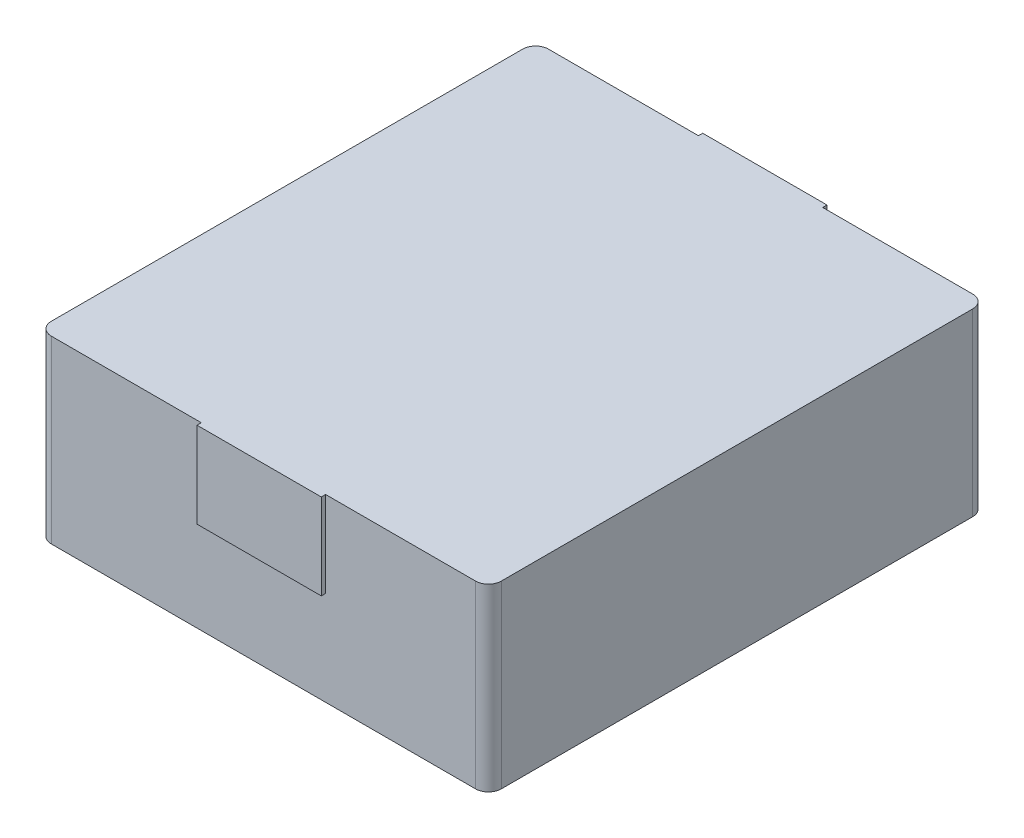
ISO-10303-21;
HEADER;
FILE_DESCRIPTION(('STEP AP214'),'2;1');
FILE_NAME('part.step','',(''),(''),'','','');
FILE_SCHEMA(('AUTOMOTIVE_DESIGN { 1 0 10303 214 1 1 1 1 }'));
ENDSEC;
DATA;
#1=APPLICATION_CONTEXT('core data for automotive mechanical design processes');
#2=APPLICATION_PROTOCOL_DEFINITION('international standard','automotive_design',2000,#1);
#3=PRODUCT_CONTEXT('',#1,'mechanical');
#4=PRODUCT('Part','Part','',(#3));
#5=PRODUCT_RELATED_PRODUCT_CATEGORY('part','',(#4));
#6=PRODUCT_DEFINITION_FORMATION('','',#4);
#7=PRODUCT_DEFINITION_CONTEXT('part definition',#1,'design');
#8=PRODUCT_DEFINITION('design','',#6,#7);
#9=PRODUCT_DEFINITION_SHAPE('','',#8);
#10=(LENGTH_UNIT() NAMED_UNIT(*) SI_UNIT(.MILLI.,.METRE.));
#11=(NAMED_UNIT(*) PLANE_ANGLE_UNIT() SI_UNIT($,.RADIAN.));
#12=(NAMED_UNIT(*) SI_UNIT($,.STERADIAN.) SOLID_ANGLE_UNIT());
#13=UNCERTAINTY_MEASURE_WITH_UNIT(LENGTH_MEASURE(1.E-05),#10,'distance_accuracy_value','');
#14=(GEOMETRIC_REPRESENTATION_CONTEXT(3) GLOBAL_UNCERTAINTY_ASSIGNED_CONTEXT((#13)) GLOBAL_UNIT_ASSIGNED_CONTEXT((#10,
#11,#12)) REPRESENTATION_CONTEXT('',''));
#15=CARTESIAN_POINT('',(0.,0.,0.));
#16=DIRECTION('',(0.,0.,1.));
#17=DIRECTION('',(1.,0.,0.));
#18=AXIS2_PLACEMENT_3D('',#15,#16,#17);
#19=CARTESIAN_POINT('',(13.1,5.75,-24.5));
#20=DIRECTION('',(0.,1.,0.));
#21=DIRECTION('',(0.,0.,-1.));
#22=AXIS2_PLACEMENT_3D('',#19,#20,#21);
#23=PLANE('',#22);
#24=DIRECTION('',(0.,0.,-1.));
#25=VECTOR('',#24,1.);
#26=CARTESIAN_POINT('',(10.2,5.75,-24.55));
#27=LINE('',#26,#25);
#28=CARTESIAN_POINT('',(10.2,5.75,-24.5));
#29=VERTEX_POINT('',#28);
#30=CARTESIAN_POINT('',(10.2,5.75,-24.6));
#31=VERTEX_POINT('',#30);
#32=EDGE_CURVE('E200',#29,#31,#27,.T.);
#33=ORIENTED_EDGE('',*,*,#32,.T.);
#34=DIRECTION('',(-1.,0.,0.));
#35=VECTOR('',#34,1.);
#36=CARTESIAN_POINT('',(11.65,5.75,-24.6));
#37=LINE('',#36,#35);
#38=CARTESIAN_POINT('',(13.1,5.75,-24.6));
#39=VERTEX_POINT('',#38);
#40=EDGE_CURVE('E152',#39,#31,#37,.T.);
#41=ORIENTED_EDGE('',*,*,#40,.F.);
#42=DIRECTION('',(0.,0.,1.));
#43=VECTOR('',#42,1.);
#44=CARTESIAN_POINT('',(13.1,5.75,-24.55));
#45=LINE('',#44,#43);
#46=CARTESIAN_POINT('',(13.1,5.75,-24.5));
#47=VERTEX_POINT('',#46);
#48=EDGE_CURVE('E199',#39,#47,#45,.T.);
#49=ORIENTED_EDGE('',*,*,#48,.T.);
#50=DIRECTION('',(-1.,0.,0.));
#51=VECTOR('',#50,1.);
#52=CARTESIAN_POINT('',(11.65,5.75,-24.5));
#53=LINE('',#52,#51);
#54=EDGE_CURVE('E240',#47,#29,#53,.T.);
#55=ORIENTED_EDGE('',*,*,#54,.T.);
#56=EDGE_LOOP('',(#33,#41,#49,#55));
#57=FACE_BOUND('',#56,.T.);
#58=ADVANCED_FACE('F17',(#57),#23,.F.);
#59=CARTESIAN_POINT('',(10.2,7.75,-24.6));
#60=DIRECTION('',(1.,0.,0.));
#61=DIRECTION('',(0.,0.,1.));
#62=AXIS2_PLACEMENT_3D('',#59,#60,#61);
#63=PLANE('',#62);
#64=ORIENTED_EDGE('',*,*,#32,.F.);
#65=DIRECTION('',(0.,1.,0.));
#66=VECTOR('',#65,1.);
#67=CARTESIAN_POINT('',(10.2,6.75,-24.5));
#68=LINE('',#67,#66);
#69=CARTESIAN_POINT('',(10.2,7.75,-24.5));
#70=VERTEX_POINT('',#69);
#71=EDGE_CURVE('E209',#29,#70,#68,.T.);
#72=ORIENTED_EDGE('',*,*,#71,.T.);
#73=DIRECTION('',(0.,0.,1.));
#74=VECTOR('',#73,1.);
#75=CARTESIAN_POINT('',(10.2,7.75,-24.55));
#76=LINE('',#75,#74);
#77=CARTESIAN_POINT('',(10.2,7.75,-24.6));
#78=VERTEX_POINT('',#77);
#79=EDGE_CURVE('E71',#78,#70,#76,.T.);
#80=ORIENTED_EDGE('',*,*,#79,.F.);
#81=DIRECTION('',(0.,1.,0.));
#82=VECTOR('',#81,1.);
#83=CARTESIAN_POINT('',(10.2,5.65,-24.6));
#84=LINE('',#83,#82);
#85=EDGE_CURVE('E150',#31,#78,#84,.T.);
#86=ORIENTED_EDGE('',*,*,#85,.F.);
#87=EDGE_LOOP('',(#64,#72,#80,#86));
#88=FACE_BOUND('',#87,.T.);
#89=ADVANCED_FACE('F327',(#88),#63,.F.);
#90=CARTESIAN_POINT('',(13.1,7.75,-24.5));
#91=DIRECTION('',(-1.,0.,0.));
#92=DIRECTION('',(0.,0.,-1.));
#93=AXIS2_PLACEMENT_3D('',#90,#91,#92);
#94=PLANE('',#93);
#95=ORIENTED_EDGE('',*,*,#48,.F.);
#96=DIRECTION('',(0.,-1.,0.));
#97=VECTOR('',#96,1.);
#98=CARTESIAN_POINT('',(13.1,5.65,-24.6));
#99=LINE('',#98,#97);
#100=CARTESIAN_POINT('',(13.1,7.75,-24.6));
#101=VERTEX_POINT('',#100);
#102=EDGE_CURVE('E146',#101,#39,#99,.T.);
#103=ORIENTED_EDGE('',*,*,#102,.F.);
#104=DIRECTION('',(0.,0.,-1.));
#105=VECTOR('',#104,1.);
#106=CARTESIAN_POINT('',(13.1,7.75,-24.55));
#107=LINE('',#106,#105);
#108=CARTESIAN_POINT('',(13.1,7.75,-24.5));
#109=VERTEX_POINT('',#108);
#110=EDGE_CURVE('E196',#109,#101,#107,.T.);
#111=ORIENTED_EDGE('',*,*,#110,.F.);
#112=DIRECTION('',(0.,-1.,0.));
#113=VECTOR('',#112,1.);
#114=CARTESIAN_POINT('',(13.1,6.75,-24.5));
#115=LINE('',#114,#113);
#116=EDGE_CURVE('E243',#109,#47,#115,.T.);
#117=ORIENTED_EDGE('',*,*,#116,.T.);
#118=EDGE_LOOP('',(#95,#103,#111,#117));
#119=FACE_BOUND('',#118,.T.);
#120=ADVANCED_FACE('F317',(#119),#94,.F.);
#121=CARTESIAN_POINT('',(6.7,3.55,-24.9));
#122=DIRECTION('',(0.,1.,0.));
#123=DIRECTION('',(0.,0.,1.));
#124=AXIS2_PLACEMENT_3D('',#121,#122,#123);
#125=CYLINDRICAL_SURFACE('',#124,0.3);
#126=CARTESIAN_POINT('',(6.7,3.55,-24.9));
#127=DIRECTION('',(0.,1.,0.));
#128=DIRECTION('',(0.,0.,1.));
#129=AXIS2_PLACEMENT_3D('',#126,#127,#128);
#130=CIRCLE('',#129,0.3);
#131=CARTESIAN_POINT('',(6.7,3.55,-24.6));
#132=VERTEX_POINT('',#131);
#133=CARTESIAN_POINT('',(6.4,3.55,-24.9));
#134=VERTEX_POINT('',#133);
#135=EDGE_CURVE('E248',#132,#134,#130,.F.);
#136=ORIENTED_EDGE('',*,*,#135,.F.);
#137=DIRECTION('',(0.,-1.,0.));
#138=VECTOR('',#137,1.);
#139=CARTESIAN_POINT('',(6.7,5.65,-24.6));
#140=LINE('',#139,#138);
#141=CARTESIAN_POINT('',(6.7,7.75,-24.6));
#142=VERTEX_POINT('',#141);
#143=EDGE_CURVE('E147',#142,#132,#140,.T.);
#144=ORIENTED_EDGE('',*,*,#143,.F.);
#145=CARTESIAN_POINT('',(6.7,7.75,-24.9));
#146=DIRECTION('',(0.,1.,0.));
#147=DIRECTION('',(0.,0.,1.));
#148=AXIS2_PLACEMENT_3D('',#145,#146,#147);
#149=CIRCLE('',#148,0.3);
#150=CARTESIAN_POINT('',(6.4,7.75,-24.9));
#151=VERTEX_POINT('',#150);
#152=EDGE_CURVE('E21',#151,#142,#149,.T.);
#153=ORIENTED_EDGE('',*,*,#152,.F.);
#154=DIRECTION('',(0.,1.,0.));
#155=VECTOR('',#154,1.);
#156=CARTESIAN_POINT('',(6.4,5.65,-24.9));
#157=LINE('',#156,#155);
#158=EDGE_CURVE('E141',#134,#151,#157,.T.);
#159=ORIENTED_EDGE('',*,*,#158,.F.);
#160=EDGE_LOOP('',(#136,#144,#153,#159));
#161=FACE_BOUND('',#160,.T.);
#162=ADVANCED_FACE('F314',(#161),#125,.T.);
#163=CARTESIAN_POINT('',(13.1,5.75,-36.3));
#164=DIRECTION('',(0.,-1.,0.));
#165=DIRECTION('',(0.,0.,1.));
#166=AXIS2_PLACEMENT_3D('',#163,#164,#165);
#167=PLANE('',#166);
#168=DIRECTION('',(-1.,0.,0.));
#169=VECTOR('',#168,1.);
#170=CARTESIAN_POINT('',(11.65,5.75,-36.3));
#171=LINE('',#170,#169);
#172=CARTESIAN_POINT('',(13.1,5.75,-36.3));
#173=VERTEX_POINT('',#172);
#174=CARTESIAN_POINT('',(10.2,5.75,-36.3));
#175=VERTEX_POINT('',#174);
#176=EDGE_CURVE('E221',#173,#175,#171,.T.);
#177=ORIENTED_EDGE('',*,*,#176,.F.);
#178=DIRECTION('',(0.,0.,-1.));
#179=VECTOR('',#178,1.);
#180=CARTESIAN_POINT('',(13.1,5.75,-36.25));
#181=LINE('',#180,#179);
#182=CARTESIAN_POINT('',(13.1,5.75,-36.2));
#183=VERTEX_POINT('',#182);
#184=EDGE_CURVE('E188',#183,#173,#181,.T.);
#185=ORIENTED_EDGE('',*,*,#184,.F.);
#186=DIRECTION('',(1.,0.,0.));
#187=VECTOR('',#186,1.);
#188=CARTESIAN_POINT('',(11.65,5.75,-36.2));
#189=LINE('',#188,#187);
#190=CARTESIAN_POINT('',(10.2,5.75,-36.2));
#191=VERTEX_POINT('',#190);
#192=EDGE_CURVE('E178',#191,#183,#189,.T.);
#193=ORIENTED_EDGE('',*,*,#192,.F.);
#194=DIRECTION('',(0.,0.,1.));
#195=VECTOR('',#194,1.);
#196=CARTESIAN_POINT('',(10.2,5.75,-36.25));
#197=LINE('',#196,#195);
#198=EDGE_CURVE('E170',#175,#191,#197,.T.);
#199=ORIENTED_EDGE('',*,*,#198,.F.);
#200=EDGE_LOOP('',(#177,#185,#193,#199));
#201=FACE_BOUND('',#200,.T.);
#202=ADVANCED_FACE('F316',(#201),#167,.T.);
#203=CARTESIAN_POINT('',(13.1,7.75,-36.3));
#204=DIRECTION('',(1.,0.,0.));
#205=DIRECTION('',(0.,0.,1.));
#206=AXIS2_PLACEMENT_3D('',#203,#204,#205);
#207=PLANE('',#206);
#208=DIRECTION('',(0.,-1.,0.));
#209=VECTOR('',#208,1.);
#210=CARTESIAN_POINT('',(13.1,6.75,-36.3));
#211=LINE('',#210,#209);
#212=CARTESIAN_POINT('',(13.1,7.75,-36.3));
#213=VERTEX_POINT('',#212);
#214=EDGE_CURVE('E143',#213,#173,#211,.T.);
#215=ORIENTED_EDGE('',*,*,#214,.F.);
#216=DIRECTION('',(0.,0.,1.));
#217=VECTOR('',#216,1.);
#218=CARTESIAN_POINT('',(13.1,7.75,-36.25));
#219=LINE('',#218,#217);
#220=CARTESIAN_POINT('',(13.1,7.75,-36.2));
#221=VERTEX_POINT('',#220);
#222=EDGE_CURVE('E185',#213,#221,#219,.T.);
#223=ORIENTED_EDGE('',*,*,#222,.T.);
#224=DIRECTION('',(0.,1.,0.));
#225=VECTOR('',#224,1.);
#226=CARTESIAN_POINT('',(13.1,5.65,-36.2));
#227=LINE('',#226,#225);
#228=EDGE_CURVE('E181',#183,#221,#227,.T.);
#229=ORIENTED_EDGE('',*,*,#228,.F.);
#230=ORIENTED_EDGE('',*,*,#184,.T.);
#231=EDGE_LOOP('',(#215,#223,#229,#230));
#232=FACE_BOUND('',#231,.T.);
#233=ADVANCED_FACE('F324',(#232),#207,.T.);
#234=CARTESIAN_POINT('',(6.7,3.55,-35.9));
#235=DIRECTION('',(0.,1.,0.));
#236=DIRECTION('',(-1.,0.,0.));
#237=AXIS2_PLACEMENT_3D('',#234,#235,#236);
#238=CYLINDRICAL_SURFACE('',#237,0.300000000000002);
#239=CARTESIAN_POINT('',(6.7,3.55,-35.9));
#240=DIRECTION('',(0.,1.,0.));
#241=DIRECTION('',(-1.,0.,0.));
#242=AXIS2_PLACEMENT_3D('',#239,#240,#241);
#243=CIRCLE('',#242,0.300000000000002);
#244=CARTESIAN_POINT('',(6.4,3.55,-35.9));
#245=VERTEX_POINT('',#244);
#246=CARTESIAN_POINT('',(6.7,3.55,-36.2));
#247=VERTEX_POINT('',#246);
#248=EDGE_CURVE('E106',#245,#247,#243,.F.);
#249=ORIENTED_EDGE('',*,*,#248,.F.);
#250=DIRECTION('',(0.,-1.,0.));
#251=VECTOR('',#250,1.);
#252=CARTESIAN_POINT('',(6.4,5.65,-35.9));
#253=LINE('',#252,#251);
#254=CARTESIAN_POINT('',(6.4,7.75,-35.9));
#255=VERTEX_POINT('',#254);
#256=EDGE_CURVE('E144',#255,#245,#253,.T.);
#257=ORIENTED_EDGE('',*,*,#256,.F.);
#258=CARTESIAN_POINT('',(6.7,7.75,-35.9));
#259=DIRECTION('',(0.,1.,0.));
#260=DIRECTION('',(-1.,0.,0.));
#261=AXIS2_PLACEMENT_3D('',#258,#259,#260);
#262=CIRCLE('',#261,0.300000000000002);
#263=CARTESIAN_POINT('',(6.7,7.75,-36.2));
#264=VERTEX_POINT('',#263);
#265=EDGE_CURVE('E129',#264,#255,#262,.T.);
#266=ORIENTED_EDGE('',*,*,#265,.F.);
#267=DIRECTION('',(0.,1.,0.));
#268=VECTOR('',#267,1.);
#269=CARTESIAN_POINT('',(6.7,5.65,-36.2));
#270=LINE('',#269,#268);
#271=EDGE_CURVE('E121',#247,#264,#270,.T.);
#272=ORIENTED_EDGE('',*,*,#271,.F.);
#273=EDGE_LOOP('',(#249,#257,#266,#272));
#274=FACE_BOUND('',#273,.T.);
#275=ADVANCED_FACE('F128',(#274),#238,.T.);
#276=CARTESIAN_POINT('',(10.2,7.75,-36.2));
#277=DIRECTION('',(-1.,0.,0.));
#278=DIRECTION('',(0.,0.,-1.));
#279=AXIS2_PLACEMENT_3D('',#276,#277,#278);
#280=PLANE('',#279);
#281=DIRECTION('',(0.,1.,0.));
#282=VECTOR('',#281,1.);
#283=CARTESIAN_POINT('',(10.2,6.75,-36.3));
#284=LINE('',#283,#282);
#285=CARTESIAN_POINT('',(10.2,7.75,-36.3));
#286=VERTEX_POINT('',#285);
#287=EDGE_CURVE('E182',#175,#286,#284,.T.);
#288=ORIENTED_EDGE('',*,*,#287,.F.);
#289=ORIENTED_EDGE('',*,*,#198,.T.);
#290=DIRECTION('',(0.,-1.,0.));
#291=VECTOR('',#290,1.);
#292=CARTESIAN_POINT('',(10.2,5.65,-36.2));
#293=LINE('',#292,#291);
#294=CARTESIAN_POINT('',(10.2,7.75,-36.2));
#295=VERTEX_POINT('',#294);
#296=EDGE_CURVE('E130',#295,#191,#293,.T.);
#297=ORIENTED_EDGE('',*,*,#296,.F.);
#298=DIRECTION('',(0.,0.,-1.));
#299=VECTOR('',#298,1.);
#300=CARTESIAN_POINT('',(10.2,7.75,-36.25));
#301=LINE('',#300,#299);
#302=EDGE_CURVE('E167',#295,#286,#301,.T.);
#303=ORIENTED_EDGE('',*,*,#302,.T.);
#304=EDGE_LOOP('',(#288,#289,#297,#303));
#305=FACE_BOUND('',#304,.T.);
#306=ADVANCED_FACE('F355',(#305),#280,.T.);
#307=CARTESIAN_POINT('',(16.6,3.55,-35.9));
#308=DIRECTION('',(0.,1.,0.));
#309=DIRECTION('',(0.,0.,1.));
#310=AXIS2_PLACEMENT_3D('',#307,#308,#309);
#311=CYLINDRICAL_SURFACE('',#310,0.300000000000002);
#312=CARTESIAN_POINT('',(16.6,3.55,-35.9));
#313=DIRECTION('',(0.,1.,0.));
#314=DIRECTION('',(0.,0.,1.));
#315=AXIS2_PLACEMENT_3D('',#312,#313,#314);
#316=CIRCLE('',#315,0.300000000000002);
#317=CARTESIAN_POINT('',(16.6,3.55,-36.2));
#318=VERTEX_POINT('',#317);
#319=CARTESIAN_POINT('',(16.9,3.55,-35.9));
#320=VERTEX_POINT('',#319);
#321=EDGE_CURVE('E115',#318,#320,#316,.F.);
#322=ORIENTED_EDGE('',*,*,#321,.F.);
#323=DIRECTION('',(0.,-1.,0.));
#324=VECTOR('',#323,1.);
#325=CARTESIAN_POINT('',(16.6,5.65,-36.2));
#326=LINE('',#325,#324);
#327=CARTESIAN_POINT('',(16.6,7.75,-36.2));
#328=VERTEX_POINT('',#327);
#329=EDGE_CURVE('E125',#328,#318,#326,.T.);
#330=ORIENTED_EDGE('',*,*,#329,.F.);
#331=CARTESIAN_POINT('',(16.6,7.75,-35.9));
#332=DIRECTION('',(0.,1.,0.));
#333=DIRECTION('',(0.,0.,1.));
#334=AXIS2_PLACEMENT_3D('',#331,#332,#333);
#335=CIRCLE('',#334,0.300000000000002);
#336=CARTESIAN_POINT('',(16.9,7.75,-35.9));
#337=VERTEX_POINT('',#336);
#338=EDGE_CURVE('E175',#337,#328,#335,.T.);
#339=ORIENTED_EDGE('',*,*,#338,.F.);
#340=DIRECTION('',(0.,1.,0.));
#341=VECTOR('',#340,1.);
#342=CARTESIAN_POINT('',(16.9,5.65,-35.9));
#343=LINE('',#342,#341);
#344=EDGE_CURVE('E133',#320,#337,#343,.T.);
#345=ORIENTED_EDGE('',*,*,#344,.F.);
#346=EDGE_LOOP('',(#322,#330,#339,#345));
#347=FACE_BOUND('',#346,.T.);
#348=ADVANCED_FACE('F302',(#347),#311,.T.);
#349=CARTESIAN_POINT('',(16.6,3.55,-24.9));
#350=DIRECTION('',(0.,1.,0.));
#351=DIRECTION('',(-1.,0.,0.));
#352=AXIS2_PLACEMENT_3D('',#349,#350,#351);
#353=CYLINDRICAL_SURFACE('',#352,0.299999999999998);
#354=CARTESIAN_POINT('',(16.6,3.55,-24.9));
#355=DIRECTION('',(0.,1.,0.));
#356=DIRECTION('',(-1.,0.,0.));
#357=AXIS2_PLACEMENT_3D('',#354,#355,#356);
#358=CIRCLE('',#357,0.299999999999998);
#359=CARTESIAN_POINT('',(16.9,3.55,-24.9));
#360=VERTEX_POINT('',#359);
#361=CARTESIAN_POINT('',(16.6,3.55,-24.6));
#362=VERTEX_POINT('',#361);
#363=EDGE_CURVE('E261',#360,#362,#358,.F.);
#364=ORIENTED_EDGE('',*,*,#363,.F.);
#365=DIRECTION('',(0.,-1.,0.));
#366=VECTOR('',#365,1.);
#367=CARTESIAN_POINT('',(16.9,5.65,-24.9));
#368=LINE('',#367,#366);
#369=CARTESIAN_POINT('',(16.9,7.75,-24.9));
#370=VERTEX_POINT('',#369);
#371=EDGE_CURVE('E166',#370,#360,#368,.T.);
#372=ORIENTED_EDGE('',*,*,#371,.F.);
#373=CARTESIAN_POINT('',(16.6,7.75,-24.9));
#374=DIRECTION('',(0.,1.,0.));
#375=DIRECTION('',(-1.,0.,0.));
#376=AXIS2_PLACEMENT_3D('',#373,#374,#375);
#377=CIRCLE('',#376,0.299999999999998);
#378=CARTESIAN_POINT('',(16.6,7.75,-24.6));
#379=VERTEX_POINT('',#378);
#380=EDGE_CURVE('E36',#379,#370,#377,.T.);
#381=ORIENTED_EDGE('',*,*,#380,.F.);
#382=DIRECTION('',(0.,1.,0.));
#383=VECTOR('',#382,1.);
#384=CARTESIAN_POINT('',(16.6,5.65,-24.6));
#385=LINE('',#384,#383);
#386=EDGE_CURVE('E155',#362,#379,#385,.T.);
#387=ORIENTED_EDGE('',*,*,#386,.F.);
#388=EDGE_LOOP('',(#364,#372,#381,#387));
#389=FACE_BOUND('',#388,.T.);
#390=ADVANCED_FACE('F309',(#389),#353,.T.);
#391=CARTESIAN_POINT('',(17.00605,3.55,-36.316));
#392=DIRECTION('',(0.,-1.,0.));
#393=DIRECTION('',(0.,0.,1.));
#394=AXIS2_PLACEMENT_3D('',#391,#392,#393);
#395=PLANE('',#394);
#396=ORIENTED_EDGE('',*,*,#135,.T.);
#397=DIRECTION('',(0.,0.,1.));
#398=VECTOR('',#397,1.);
#399=CARTESIAN_POINT('',(6.4,3.55,-30.4));
#400=LINE('',#399,#398);
#401=EDGE_CURVE('E111',#245,#134,#400,.T.);
#402=ORIENTED_EDGE('',*,*,#401,.F.);
#403=ORIENTED_EDGE('',*,*,#248,.T.);
#404=DIRECTION('',(-1.,0.,0.));
#405=VECTOR('',#404,1.);
#406=CARTESIAN_POINT('',(11.65,3.55,-36.2));
#407=LINE('',#406,#405);
#408=EDGE_CURVE('E109',#318,#247,#407,.T.);
#409=ORIENTED_EDGE('',*,*,#408,.F.);
#410=ORIENTED_EDGE('',*,*,#321,.T.);
#411=DIRECTION('',(0.,0.,-1.));
#412=VECTOR('',#411,1.);
#413=CARTESIAN_POINT('',(16.9,3.55,-30.4));
#414=LINE('',#413,#412);
#415=EDGE_CURVE('E162',#360,#320,#414,.T.);
#416=ORIENTED_EDGE('',*,*,#415,.F.);
#417=ORIENTED_EDGE('',*,*,#363,.T.);
#418=DIRECTION('',(1.,0.,0.));
#419=VECTOR('',#418,1.);
#420=CARTESIAN_POINT('',(11.65,3.55,-24.6));
#421=LINE('',#420,#419);
#422=EDGE_CURVE('E149',#132,#362,#421,.T.);
#423=ORIENTED_EDGE('',*,*,#422,.F.);
#424=EDGE_LOOP('',(#396,#402,#403,#409,#410,#416,#417,#423));
#425=FACE_BOUND('',#424,.T.);
#426=ADVANCED_FACE('F108',(#425),#395,.T.);
#427=CARTESIAN_POINT('',(10.2,7.75,-24.5));
#428=DIRECTION('',(0.,0.,-1.));
#429=DIRECTION('',(1.,0.,0.));
#430=AXIS2_PLACEMENT_3D('',#427,#428,#429);
#431=PLANE('',#430);
#432=ORIENTED_EDGE('',*,*,#54,.F.);
#433=ORIENTED_EDGE('',*,*,#116,.F.);
#434=DIRECTION('',(-1.,0.,0.));
#435=VECTOR('',#434,1.);
#436=CARTESIAN_POINT('',(11.650525,7.75,-24.5));
#437=LINE('',#436,#435);
#438=EDGE_CURVE('E251',#109,#70,#437,.T.);
#439=ORIENTED_EDGE('',*,*,#438,.T.);
#440=ORIENTED_EDGE('',*,*,#71,.F.);
#441=EDGE_LOOP('',(#432,#433,#439,#440));
#442=FACE_BOUND('',#441,.T.);
#443=ADVANCED_FACE('F349',(#442),#431,.F.);
#444=CARTESIAN_POINT('',(16.6,7.75,-24.6));
#445=DIRECTION('',(0.,0.,1.));
#446=DIRECTION('',(-1.,0.,0.));
#447=AXIS2_PLACEMENT_3D('',#444,#445,#446);
#448=PLANE('',#447);
#449=DIRECTION('',(-1.,0.,0.));
#450=VECTOR('',#449,1.);
#451=CARTESIAN_POINT('',(11.650525,7.75,-24.6));
#452=LINE('',#451,#450);
#453=EDGE_CURVE('E165',#379,#101,#452,.T.);
#454=ORIENTED_EDGE('',*,*,#453,.T.);
#455=ORIENTED_EDGE('',*,*,#102,.T.);
#456=ORIENTED_EDGE('',*,*,#40,.T.);
#457=ORIENTED_EDGE('',*,*,#85,.T.);
#458=DIRECTION('',(-1.,0.,0.));
#459=VECTOR('',#458,1.);
#460=CARTESIAN_POINT('',(11.650525,7.75,-24.6));
#461=LINE('',#460,#459);
#462=EDGE_CURVE('E254',#78,#142,#461,.T.);
#463=ORIENTED_EDGE('',*,*,#462,.T.);
#464=ORIENTED_EDGE('',*,*,#143,.T.);
#465=ORIENTED_EDGE('',*,*,#422,.T.);
#466=ORIENTED_EDGE('',*,*,#386,.T.);
#467=EDGE_LOOP('',(#454,#455,#456,#457,#463,#464,#465,#466));
#468=FACE_BOUND('',#467,.T.);
#469=ADVANCED_FACE('F312',(#468),#448,.T.);
#470=CARTESIAN_POINT('',(6.4,7.75,-24.9));
#471=DIRECTION('',(-1.,0.,0.));
#472=DIRECTION('',(0.,0.,-1.));
#473=AXIS2_PLACEMENT_3D('',#470,#471,#472);
#474=PLANE('',#473);
#475=ORIENTED_EDGE('',*,*,#158,.T.);
#476=DIRECTION('',(0.,0.,-1.));
#477=VECTOR('',#476,1.);
#478=CARTESIAN_POINT('',(6.4,7.75,-30.4));
#479=LINE('',#478,#477);
#480=EDGE_CURVE('E266',#151,#255,#479,.T.);
#481=ORIENTED_EDGE('',*,*,#480,.T.);
#482=ORIENTED_EDGE('',*,*,#256,.T.);
#483=ORIENTED_EDGE('',*,*,#401,.T.);
#484=EDGE_LOOP('',(#475,#481,#482,#483));
#485=FACE_BOUND('',#484,.T.);
#486=ADVANCED_FACE('F269',(#485),#474,.T.);
#487=CARTESIAN_POINT('',(10.2,7.75,-36.3));
#488=DIRECTION('',(0.,0.,-1.));
#489=DIRECTION('',(1.,0.,0.));
#490=AXIS2_PLACEMENT_3D('',#487,#488,#489);
#491=PLANE('',#490);
#492=ORIENTED_EDGE('',*,*,#176,.T.);
#493=ORIENTED_EDGE('',*,*,#287,.T.);
#494=DIRECTION('',(1.,0.,0.));
#495=VECTOR('',#494,1.);
#496=CARTESIAN_POINT('',(11.650525,7.75,-36.3));
#497=LINE('',#496,#495);
#498=EDGE_CURVE('E230',#286,#213,#497,.T.);
#499=ORIENTED_EDGE('',*,*,#498,.T.);
#500=ORIENTED_EDGE('',*,*,#214,.T.);
#501=EDGE_LOOP('',(#492,#493,#499,#500));
#502=FACE_BOUND('',#501,.T.);
#503=ADVANCED_FACE('F339',(#502),#491,.T.);
#504=CARTESIAN_POINT('',(6.7,7.75,-36.2));
#505=DIRECTION('',(0.,0.,-1.));
#506=DIRECTION('',(1.,0.,0.));
#507=AXIS2_PLACEMENT_3D('',#504,#505,#506);
#508=PLANE('',#507);
#509=DIRECTION('',(1.,0.,0.));
#510=VECTOR('',#509,1.);
#511=CARTESIAN_POINT('',(11.650525,7.75,-36.2));
#512=LINE('',#511,#510);
#513=EDGE_CURVE('E233',#264,#295,#512,.T.);
#514=ORIENTED_EDGE('',*,*,#513,.T.);
#515=ORIENTED_EDGE('',*,*,#296,.T.);
#516=ORIENTED_EDGE('',*,*,#192,.T.);
#517=ORIENTED_EDGE('',*,*,#228,.T.);
#518=DIRECTION('',(1.,0.,0.));
#519=VECTOR('',#518,1.);
#520=CARTESIAN_POINT('',(11.650525,7.75,-36.2));
#521=LINE('',#520,#519);
#522=EDGE_CURVE('E27',#221,#328,#521,.T.);
#523=ORIENTED_EDGE('',*,*,#522,.T.);
#524=ORIENTED_EDGE('',*,*,#329,.T.);
#525=ORIENTED_EDGE('',*,*,#408,.T.);
#526=ORIENTED_EDGE('',*,*,#271,.T.);
#527=EDGE_LOOP('',(#514,#515,#516,#517,#523,#524,#525,#526));
#528=FACE_BOUND('',#527,.T.);
#529=ADVANCED_FACE('F120',(#528),#508,.T.);
#530=CARTESIAN_POINT('',(16.9,7.75,-35.9));
#531=DIRECTION('',(1.,0.,0.));
#532=DIRECTION('',(0.,0.,1.));
#533=AXIS2_PLACEMENT_3D('',#530,#531,#532);
#534=PLANE('',#533);
#535=ORIENTED_EDGE('',*,*,#371,.T.);
#536=ORIENTED_EDGE('',*,*,#415,.T.);
#537=ORIENTED_EDGE('',*,*,#344,.T.);
#538=DIRECTION('',(0.,0.,1.));
#539=VECTOR('',#538,1.);
#540=CARTESIAN_POINT('',(16.9,7.75,-30.4));
#541=LINE('',#540,#539);
#542=EDGE_CURVE('E11',#337,#370,#541,.T.);
#543=ORIENTED_EDGE('',*,*,#542,.T.);
#544=EDGE_LOOP('',(#535,#536,#537,#543));
#545=FACE_BOUND('',#544,.T.);
#546=ADVANCED_FACE('F305',(#545),#534,.T.);
#547=CARTESIAN_POINT('',(17.00605,7.75,-36.3));
#548=DIRECTION('',(0.,-1.,0.));
#549=DIRECTION('',(0.,0.,1.));
#550=AXIS2_PLACEMENT_3D('',#547,#548,#549);
#551=PLANE('',#550);
#552=ORIENTED_EDGE('',*,*,#542,.F.);
#553=ORIENTED_EDGE('',*,*,#338,.T.);
#554=ORIENTED_EDGE('',*,*,#522,.F.);
#555=ORIENTED_EDGE('',*,*,#222,.F.);
#556=ORIENTED_EDGE('',*,*,#498,.F.);
#557=ORIENTED_EDGE('',*,*,#302,.F.);
#558=ORIENTED_EDGE('',*,*,#513,.F.);
#559=ORIENTED_EDGE('',*,*,#265,.T.);
#560=ORIENTED_EDGE('',*,*,#480,.F.);
#561=ORIENTED_EDGE('',*,*,#152,.T.);
#562=ORIENTED_EDGE('',*,*,#462,.F.);
#563=ORIENTED_EDGE('',*,*,#79,.T.);
#564=ORIENTED_EDGE('',*,*,#438,.F.);
#565=ORIENTED_EDGE('',*,*,#110,.T.);
#566=ORIENTED_EDGE('',*,*,#453,.F.);
#567=ORIENTED_EDGE('',*,*,#380,.T.);
#568=EDGE_LOOP('',(#552,#553,#554,#555,#556,#557,#558,#559,#560,#561,#562,#563,#564,#565,#566,#567));
#569=FACE_BOUND('',#568,.T.);
#570=ADVANCED_FACE('F19',(#569),#551,.F.);
#571=CLOSED_SHELL('',(#58,#89,#120,#162,#202,#233,#275,#306,#348,#390,#426,#443,#469,#486,#503,
#529,#546,#570));
#572=MANIFOLD_SOLID_BREP('B1',#571);
#573=ADVANCED_BREP_SHAPE_REPRESENTATION('',(#18,#572),#14);
#574=SHAPE_DEFINITION_REPRESENTATION(#9,#573);
ENDSEC;
END-ISO-10303-21;
